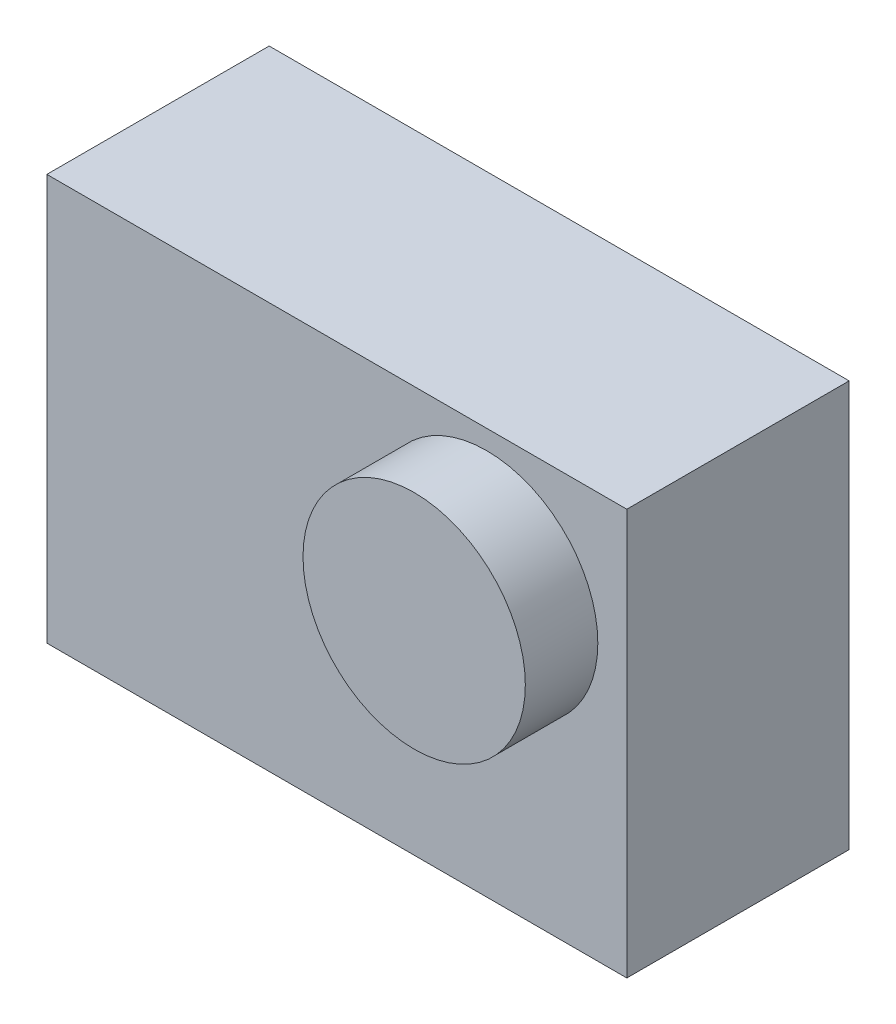
ISO-10303-21;
HEADER;
FILE_DESCRIPTION(('STEP AP214'),'2;1');
FILE_NAME('part.step','',(''),(''),'','','');
FILE_SCHEMA(('AUTOMOTIVE_DESIGN { 1 0 10303 214 1 1 1 1 }'));
ENDSEC;
DATA;
#1=APPLICATION_CONTEXT('core data for automotive mechanical design processes');
#2=APPLICATION_PROTOCOL_DEFINITION('international standard','automotive_design',2000,#1);
#3=PRODUCT_CONTEXT('',#1,'mechanical');
#4=PRODUCT('Part','Part','',(#3));
#5=PRODUCT_RELATED_PRODUCT_CATEGORY('part','',(#4));
#6=PRODUCT_DEFINITION_FORMATION('','',#4);
#7=PRODUCT_DEFINITION_CONTEXT('part definition',#1,'design');
#8=PRODUCT_DEFINITION('design','',#6,#7);
#9=PRODUCT_DEFINITION_SHAPE('','',#8);
#10=(LENGTH_UNIT() NAMED_UNIT(*) SI_UNIT(.MILLI.,.METRE.));
#11=(NAMED_UNIT(*) PLANE_ANGLE_UNIT() SI_UNIT($,.RADIAN.));
#12=(NAMED_UNIT(*) SI_UNIT($,.STERADIAN.) SOLID_ANGLE_UNIT());
#13=UNCERTAINTY_MEASURE_WITH_UNIT(LENGTH_MEASURE(1.E-05),#10,'distance_accuracy_value','');
#14=(GEOMETRIC_REPRESENTATION_CONTEXT(3) GLOBAL_UNCERTAINTY_ASSIGNED_CONTEXT((#13)) GLOBAL_UNIT_ASSIGNED_CONTEXT((#10,
#11,#12)) REPRESENTATION_CONTEXT('',''));
#15=CARTESIAN_POINT('',(0.,0.,0.));
#16=DIRECTION('',(0.,0.,1.));
#17=DIRECTION('',(1.,0.,0.));
#18=AXIS2_PLACEMENT_3D('',#15,#16,#17);
#19=CARTESIAN_POINT('',(0.,-21.,11.5));
#20=DIRECTION('',(0.,1.,0.));
#21=DIRECTION('',(0.,0.,1.));
#22=AXIS2_PLACEMENT_3D('',#19,#20,#21);
#23=PLANE('',#22);
#24=DIRECTION('',(1.,0.,0.));
#25=VECTOR('',#24,1.);
#26=CARTESIAN_POINT('',(0.,-21.,-11.5));
#27=LINE('',#26,#25);
#28=CARTESIAN_POINT('',(-30.,-21.,-11.5));
#29=VERTEX_POINT('',#28);
#30=CARTESIAN_POINT('',(30.,-21.,-11.5));
#31=VERTEX_POINT('',#30);
#32=EDGE_CURVE('E111',#29,#31,#27,.T.);
#33=ORIENTED_EDGE('',*,*,#32,.T.);
#34=DIRECTION('',(0.,0.,-1.));
#35=VECTOR('',#34,1.);
#36=CARTESIAN_POINT('',(30.,-21.,11.5));
#37=LINE('',#36,#35);
#38=CARTESIAN_POINT('',(30.,-21.,11.5));
#39=VERTEX_POINT('',#38);
#40=EDGE_CURVE('E11',#39,#31,#37,.T.);
#41=ORIENTED_EDGE('',*,*,#40,.F.);
#42=DIRECTION('',(1.,0.,0.));
#43=VECTOR('',#42,1.);
#44=CARTESIAN_POINT('',(0.,-21.,11.5));
#45=LINE('',#44,#43);
#46=CARTESIAN_POINT('',(-30.,-21.,11.5));
#47=VERTEX_POINT('',#46);
#48=EDGE_CURVE('E93',#47,#39,#45,.T.);
#49=ORIENTED_EDGE('',*,*,#48,.F.);
#50=DIRECTION('',(0.,0.,-1.));
#51=VECTOR('',#50,1.);
#52=CARTESIAN_POINT('',(-30.,-21.,11.5));
#53=LINE('',#52,#51);
#54=EDGE_CURVE('E60',#47,#29,#53,.T.);
#55=ORIENTED_EDGE('',*,*,#54,.T.);
#56=EDGE_LOOP('',(#33,#41,#49,#55));
#57=FACE_BOUND('',#56,.T.);
#58=ADVANCED_FACE('F43',(#57),#23,.F.);
#59=CARTESIAN_POINT('',(30.,0.,11.5));
#60=DIRECTION('',(-1.,0.,0.));
#61=DIRECTION('',(0.,0.,1.));
#62=AXIS2_PLACEMENT_3D('',#59,#60,#61);
#63=PLANE('',#62);
#64=DIRECTION('',(0.,1.,0.));
#65=VECTOR('',#64,1.);
#66=CARTESIAN_POINT('',(30.,0.,-11.5));
#67=LINE('',#66,#65);
#68=CARTESIAN_POINT('',(30.,21.,-11.5));
#69=VERTEX_POINT('',#68);
#70=EDGE_CURVE('E99',#31,#69,#67,.T.);
#71=ORIENTED_EDGE('',*,*,#70,.T.);
#72=DIRECTION('',(0.,0.,-1.));
#73=VECTOR('',#72,1.);
#74=CARTESIAN_POINT('',(30.,21.,11.5));
#75=LINE('',#74,#73);
#76=CARTESIAN_POINT('',(30.,21.,11.5));
#77=VERTEX_POINT('',#76);
#78=EDGE_CURVE('E52',#77,#69,#75,.T.);
#79=ORIENTED_EDGE('',*,*,#78,.F.);
#80=DIRECTION('',(0.,1.,0.));
#81=VECTOR('',#80,1.);
#82=CARTESIAN_POINT('',(30.,0.,11.5));
#83=LINE('',#82,#81);
#84=EDGE_CURVE('E85',#39,#77,#83,.T.);
#85=ORIENTED_EDGE('',*,*,#84,.F.);
#86=ORIENTED_EDGE('',*,*,#40,.T.);
#87=EDGE_LOOP('',(#71,#79,#85,#86));
#88=FACE_BOUND('',#87,.T.);
#89=ADVANCED_FACE('F98',(#88),#63,.F.);
#90=CARTESIAN_POINT('',(0.,21.,11.5));
#91=DIRECTION('',(0.,1.,0.));
#92=DIRECTION('',(0.,0.,1.));
#93=AXIS2_PLACEMENT_3D('',#90,#91,#92);
#94=PLANE('',#93);
#95=DIRECTION('',(1.,0.,0.));
#96=VECTOR('',#95,1.);
#97=CARTESIAN_POINT('',(0.,21.,-11.5));
#98=LINE('',#97,#96);
#99=CARTESIAN_POINT('',(-30.,21.,-11.5));
#100=VERTEX_POINT('',#99);
#101=EDGE_CURVE('E117',#100,#69,#98,.T.);
#102=ORIENTED_EDGE('',*,*,#101,.F.);
#103=DIRECTION('',(0.,0.,-1.));
#104=VECTOR('',#103,1.);
#105=CARTESIAN_POINT('',(-30.,21.,11.5));
#106=LINE('',#105,#104);
#107=CARTESIAN_POINT('',(-30.,21.,11.5));
#108=VERTEX_POINT('',#107);
#109=EDGE_CURVE('E74',#108,#100,#106,.T.);
#110=ORIENTED_EDGE('',*,*,#109,.F.);
#111=DIRECTION('',(1.,0.,0.));
#112=VECTOR('',#111,1.);
#113=CARTESIAN_POINT('',(0.,21.,11.5));
#114=LINE('',#113,#112);
#115=EDGE_CURVE('E92',#108,#77,#114,.T.);
#116=ORIENTED_EDGE('',*,*,#115,.T.);
#117=ORIENTED_EDGE('',*,*,#78,.T.);
#118=EDGE_LOOP('',(#102,#110,#116,#117));
#119=FACE_BOUND('',#118,.T.);
#120=ADVANCED_FACE('F103',(#119),#94,.T.);
#121=CARTESIAN_POINT('',(-30.,0.,11.5));
#122=DIRECTION('',(-1.,0.,0.));
#123=DIRECTION('',(0.,0.,1.));
#124=AXIS2_PLACEMENT_3D('',#121,#122,#123);
#125=PLANE('',#124);
#126=DIRECTION('',(0.,1.,0.));
#127=VECTOR('',#126,1.);
#128=CARTESIAN_POINT('',(-30.,0.,-11.5));
#129=LINE('',#128,#127);
#130=EDGE_CURVE('E120',#29,#100,#129,.T.);
#131=ORIENTED_EDGE('',*,*,#130,.F.);
#132=ORIENTED_EDGE('',*,*,#54,.F.);
#133=DIRECTION('',(0.,1.,0.));
#134=VECTOR('',#133,1.);
#135=CARTESIAN_POINT('',(-30.,0.,11.5));
#136=LINE('',#135,#134);
#137=EDGE_CURVE('E105',#47,#108,#136,.T.);
#138=ORIENTED_EDGE('',*,*,#137,.T.);
#139=ORIENTED_EDGE('',*,*,#109,.T.);
#140=EDGE_LOOP('',(#131,#132,#138,#139));
#141=FACE_BOUND('',#140,.T.);
#142=ADVANCED_FACE('F148',(#141),#125,.T.);
#143=CARTESIAN_POINT('',(0.,0.,11.5));
#144=DIRECTION('',(0.,0.,1.));
#145=DIRECTION('',(1.,0.,0.));
#146=AXIS2_PLACEMENT_3D('',#143,#144,#145);
#147=PLANE('',#146);
#148=CARTESIAN_POINT('',(15.5,7.5,11.5));
#149=DIRECTION('',(0.,0.,1.));
#150=DIRECTION('',(1.,0.,0.));
#151=AXIS2_PLACEMENT_3D('',#148,#149,#150);
#152=CIRCLE('',#151,11.5);
#153=CARTESIAN_POINT('',(27.,7.5,11.5));
#154=VERTEX_POINT('',#153);
#155=EDGE_CURVE('E130',#154,#154,#152,.T.);
#156=ORIENTED_EDGE('',*,*,#155,.F.);
#157=EDGE_LOOP('',(#156));
#158=FACE_BOUND('',#157,.T.);
#159=ORIENTED_EDGE('',*,*,#48,.T.);
#160=ORIENTED_EDGE('',*,*,#84,.T.);
#161=ORIENTED_EDGE('',*,*,#115,.F.);
#162=ORIENTED_EDGE('',*,*,#137,.F.);
#163=EDGE_LOOP('',(#159,#160,#161,#162));
#164=FACE_BOUND('',#163,.T.);
#165=ADVANCED_FACE('F89',(#158,#164),#147,.T.);
#166=CARTESIAN_POINT('',(0.,0.,-11.5));
#167=DIRECTION('',(0.,0.,1.));
#168=DIRECTION('',(1.,0.,0.));
#169=AXIS2_PLACEMENT_3D('',#166,#167,#168);
#170=PLANE('',#169);
#171=ORIENTED_EDGE('',*,*,#32,.F.);
#172=ORIENTED_EDGE('',*,*,#130,.T.);
#173=ORIENTED_EDGE('',*,*,#101,.T.);
#174=ORIENTED_EDGE('',*,*,#70,.F.);
#175=EDGE_LOOP('',(#171,#172,#173,#174));
#176=FACE_BOUND('',#175,.T.);
#177=ADVANCED_FACE('F143',(#176),#170,.F.);
#178=CARTESIAN_POINT('',(15.5,7.5,19.));
#179=DIRECTION('',(0.,0.,-1.));
#180=DIRECTION('',(-1.,0.,0.));
#181=AXIS2_PLACEMENT_3D('',#178,#179,#180);
#182=CYLINDRICAL_SURFACE('',#181,11.5);
#183=CARTESIAN_POINT('',(15.5,7.5,19.));
#184=DIRECTION('',(0.,0.,1.));
#185=DIRECTION('',(1.,0.,0.));
#186=AXIS2_PLACEMENT_3D('',#183,#184,#185);
#187=CIRCLE('',#186,11.5);
#188=CARTESIAN_POINT('',(27.,7.5,19.));
#189=VERTEX_POINT('',#188);
#190=EDGE_CURVE('E114',#189,#189,#187,.T.);
#191=ORIENTED_EDGE('',*,*,#190,.F.);
#192=EDGE_LOOP('',(#191));
#193=FACE_BOUND('',#192,.T.);
#194=ORIENTED_EDGE('',*,*,#155,.T.);
#195=EDGE_LOOP('',(#194));
#196=FACE_BOUND('',#195,.T.);
#197=ADVANCED_FACE('F140',(#193,#196),#182,.T.);
#198=CARTESIAN_POINT('',(15.5,7.5,19.));
#199=DIRECTION('',(0.,0.,1.));
#200=DIRECTION('',(1.,0.,0.));
#201=AXIS2_PLACEMENT_3D('',#198,#199,#200);
#202=PLANE('',#201);
#203=ORIENTED_EDGE('',*,*,#190,.T.);
#204=EDGE_LOOP('',(#203));
#205=FACE_BOUND('',#204,.T.);
#206=ADVANCED_FACE('F138',(#205),#202,.T.);
#207=CLOSED_SHELL('',(#58,#89,#120,#142,#165,#177,#197,#206));
#208=MANIFOLD_SOLID_BREP('B2',#207);
#209=ADVANCED_BREP_SHAPE_REPRESENTATION('',(#18,#208),#14);
#210=SHAPE_DEFINITION_REPRESENTATION(#9,#209);
ENDSEC;
END-ISO-10303-21;
